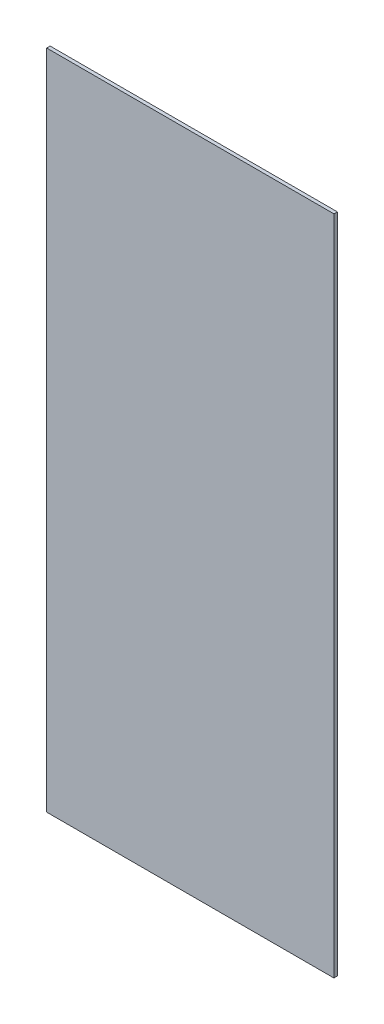
ISO-10303-21;
HEADER;
FILE_DESCRIPTION(('STEP AP214'),'2;1');
FILE_NAME('part.step','',(''),(''),'','','');
FILE_SCHEMA(('AUTOMOTIVE_DESIGN { 1 0 10303 214 1 1 1 1 }'));
ENDSEC;
DATA;
#1=APPLICATION_CONTEXT('core data for automotive mechanical design processes');
#2=APPLICATION_PROTOCOL_DEFINITION('international standard','automotive_design',2000,#1);
#3=PRODUCT_CONTEXT('',#1,'mechanical');
#4=PRODUCT('Part','Part','',(#3));
#5=PRODUCT_RELATED_PRODUCT_CATEGORY('part','',(#4));
#6=PRODUCT_DEFINITION_FORMATION('','',#4);
#7=PRODUCT_DEFINITION_CONTEXT('part definition',#1,'design');
#8=PRODUCT_DEFINITION('design','',#6,#7);
#9=PRODUCT_DEFINITION_SHAPE('','',#8);
#10=(LENGTH_UNIT() NAMED_UNIT(*) SI_UNIT(.MILLI.,.METRE.));
#11=(NAMED_UNIT(*) PLANE_ANGLE_UNIT() SI_UNIT($,.RADIAN.));
#12=(NAMED_UNIT(*) SI_UNIT($,.STERADIAN.) SOLID_ANGLE_UNIT());
#13=UNCERTAINTY_MEASURE_WITH_UNIT(LENGTH_MEASURE(1.E-05),#10,'distance_accuracy_value','');
#14=(GEOMETRIC_REPRESENTATION_CONTEXT(3) GLOBAL_UNCERTAINTY_ASSIGNED_CONTEXT((#13)) GLOBAL_UNIT_ASSIGNED_CONTEXT((#10,
#11,#12)) REPRESENTATION_CONTEXT('',''));
#15=CARTESIAN_POINT('',(0.,0.,0.));
#16=DIRECTION('',(0.,0.,1.));
#17=DIRECTION('',(1.,0.,0.));
#18=AXIS2_PLACEMENT_3D('',#15,#16,#17);
#19=CARTESIAN_POINT('',(125.,-288.,3.));
#20=DIRECTION('',(-1.,0.,0.));
#21=DIRECTION('',(0.,0.,1.));
#22=AXIS2_PLACEMENT_3D('',#19,#20,#21);
#23=PLANE('',#22);
#24=DIRECTION('',(0.,1.,0.));
#25=VECTOR('',#24,1.);
#26=CARTESIAN_POINT('',(125.,-288.,0.));
#27=LINE('',#26,#25);
#28=CARTESIAN_POINT('',(125.,-288.,0.));
#29=VERTEX_POINT('',#28);
#30=CARTESIAN_POINT('',(125.,288.,0.));
#31=VERTEX_POINT('',#30);
#32=EDGE_CURVE('E96',#29,#31,#27,.T.);
#33=ORIENTED_EDGE('',*,*,#32,.T.);
#34=DIRECTION('',(0.,0.,-1.));
#35=VECTOR('',#34,1.);
#36=CARTESIAN_POINT('',(125.,288.,3.));
#37=LINE('',#36,#35);
#38=CARTESIAN_POINT('',(125.,288.,3.));
#39=VERTEX_POINT('',#38);
#40=EDGE_CURVE('E11',#39,#31,#37,.T.);
#41=ORIENTED_EDGE('',*,*,#40,.F.);
#42=DIRECTION('',(0.,1.,0.));
#43=VECTOR('',#42,1.);
#44=CARTESIAN_POINT('',(125.,-288.,3.));
#45=LINE('',#44,#43);
#46=CARTESIAN_POINT('',(125.,-288.,3.));
#47=VERTEX_POINT('',#46);
#48=EDGE_CURVE('E84',#47,#39,#45,.T.);
#49=ORIENTED_EDGE('',*,*,#48,.F.);
#50=DIRECTION('',(0.,0.,-1.));
#51=VECTOR('',#50,1.);
#52=CARTESIAN_POINT('',(125.,-288.,3.));
#53=LINE('',#52,#51);
#54=EDGE_CURVE('E92',#47,#29,#53,.T.);
#55=ORIENTED_EDGE('',*,*,#54,.T.);
#56=EDGE_LOOP('',(#33,#41,#49,#55));
#57=FACE_BOUND('',#56,.T.);
#58=ADVANCED_FACE('F33',(#57),#23,.F.);
#59=CARTESIAN_POINT('',(-125.,288.,3.));
#60=DIRECTION('',(0.,-1.,0.));
#61=DIRECTION('',(0.,0.,-1.));
#62=AXIS2_PLACEMENT_3D('',#59,#60,#61);
#63=PLANE('',#62);
#64=DIRECTION('',(-1.,0.,0.));
#65=VECTOR('',#64,1.);
#66=CARTESIAN_POINT('',(-125.,288.,0.));
#67=LINE('',#66,#65);
#68=CARTESIAN_POINT('',(-125.,288.,0.));
#69=VERTEX_POINT('',#68);
#70=EDGE_CURVE('E88',#31,#69,#67,.T.);
#71=ORIENTED_EDGE('',*,*,#70,.T.);
#72=DIRECTION('',(0.,0.,-1.));
#73=VECTOR('',#72,1.);
#74=CARTESIAN_POINT('',(-125.,288.,3.));
#75=LINE('',#74,#73);
#76=CARTESIAN_POINT('',(-125.,288.,3.));
#77=VERTEX_POINT('',#76);
#78=EDGE_CURVE('E41',#77,#69,#75,.T.);
#79=ORIENTED_EDGE('',*,*,#78,.F.);
#80=DIRECTION('',(-1.,0.,0.));
#81=VECTOR('',#80,1.);
#82=CARTESIAN_POINT('',(-125.,288.,3.));
#83=LINE('',#82,#81);
#84=EDGE_CURVE('E79',#39,#77,#83,.T.);
#85=ORIENTED_EDGE('',*,*,#84,.F.);
#86=ORIENTED_EDGE('',*,*,#40,.T.);
#87=EDGE_LOOP('',(#71,#79,#85,#86));
#88=FACE_BOUND('',#87,.T.);
#89=ADVANCED_FACE('F87',(#88),#63,.F.);
#90=CARTESIAN_POINT('',(-125.,-288.,3.));
#91=DIRECTION('',(1.,0.,0.));
#92=DIRECTION('',(0.,0.,-1.));
#93=AXIS2_PLACEMENT_3D('',#90,#91,#92);
#94=PLANE('',#93);
#95=DIRECTION('',(0.,-1.,0.));
#96=VECTOR('',#95,1.);
#97=CARTESIAN_POINT('',(-125.,-288.,0.));
#98=LINE('',#97,#96);
#99=CARTESIAN_POINT('',(-125.,-288.,0.));
#100=VERTEX_POINT('',#99);
#101=EDGE_CURVE('E66',#69,#100,#98,.T.);
#102=ORIENTED_EDGE('',*,*,#101,.T.);
#103=DIRECTION('',(0.,0.,-1.));
#104=VECTOR('',#103,1.);
#105=CARTESIAN_POINT('',(-125.,-288.,3.));
#106=LINE('',#105,#104);
#107=CARTESIAN_POINT('',(-125.,-288.,3.));
#108=VERTEX_POINT('',#107);
#109=EDGE_CURVE('E89',#108,#100,#106,.T.);
#110=ORIENTED_EDGE('',*,*,#109,.F.);
#111=DIRECTION('',(0.,-1.,0.));
#112=VECTOR('',#111,1.);
#113=CARTESIAN_POINT('',(-125.,-288.,3.));
#114=LINE('',#113,#112);
#115=EDGE_CURVE('E82',#77,#108,#114,.T.);
#116=ORIENTED_EDGE('',*,*,#115,.F.);
#117=ORIENTED_EDGE('',*,*,#78,.T.);
#118=EDGE_LOOP('',(#102,#110,#116,#117));
#119=FACE_BOUND('',#118,.T.);
#120=ADVANCED_FACE('F90',(#119),#94,.F.);
#121=CARTESIAN_POINT('',(-125.,-288.,3.));
#122=DIRECTION('',(0.,1.,0.));
#123=DIRECTION('',(0.,0.,1.));
#124=AXIS2_PLACEMENT_3D('',#121,#122,#123);
#125=PLANE('',#124);
#126=DIRECTION('',(1.,0.,0.));
#127=VECTOR('',#126,1.);
#128=CARTESIAN_POINT('',(-125.,-288.,0.));
#129=LINE('',#128,#127);
#130=EDGE_CURVE('E72',#100,#29,#129,.T.);
#131=ORIENTED_EDGE('',*,*,#130,.T.);
#132=ORIENTED_EDGE('',*,*,#54,.F.);
#133=DIRECTION('',(1.,0.,0.));
#134=VECTOR('',#133,1.);
#135=CARTESIAN_POINT('',(-125.,-288.,3.));
#136=LINE('',#135,#134);
#137=EDGE_CURVE('E49',#108,#47,#136,.T.);
#138=ORIENTED_EDGE('',*,*,#137,.F.);
#139=ORIENTED_EDGE('',*,*,#109,.T.);
#140=EDGE_LOOP('',(#131,#132,#138,#139));
#141=FACE_BOUND('',#140,.T.);
#142=ADVANCED_FACE('F103',(#141),#125,.F.);
#143=CARTESIAN_POINT('',(0.,0.,3.));
#144=DIRECTION('',(0.,0.,-1.));
#145=DIRECTION('',(-1.,0.,0.));
#146=AXIS2_PLACEMENT_3D('',#143,#144,#145);
#147=PLANE('',#146);
#148=ORIENTED_EDGE('',*,*,#48,.T.);
#149=ORIENTED_EDGE('',*,*,#84,.T.);
#150=ORIENTED_EDGE('',*,*,#115,.T.);
#151=ORIENTED_EDGE('',*,*,#137,.T.);
#152=EDGE_LOOP('',(#148,#149,#150,#151));
#153=FACE_BOUND('',#152,.T.);
#154=ADVANCED_FACE('F80',(#153),#147,.F.);
#155=CARTESIAN_POINT('',(0.,0.,0.));
#156=DIRECTION('',(0.,0.,-1.));
#157=DIRECTION('',(-1.,0.,0.));
#158=AXIS2_PLACEMENT_3D('',#155,#156,#157);
#159=PLANE('',#158);
#160=ORIENTED_EDGE('',*,*,#32,.F.);
#161=ORIENTED_EDGE('',*,*,#130,.F.);
#162=ORIENTED_EDGE('',*,*,#101,.F.);
#163=ORIENTED_EDGE('',*,*,#70,.F.);
#164=EDGE_LOOP('',(#160,#161,#162,#163));
#165=FACE_BOUND('',#164,.T.);
#166=ADVANCED_FACE('F106',(#165),#159,.T.);
#167=CLOSED_SHELL('',(#58,#89,#120,#142,#154,#166));
#168=MANIFOLD_SOLID_BREP('B2',#167);
#169=ADVANCED_BREP_SHAPE_REPRESENTATION('',(#18,#168),#14);
#170=SHAPE_DEFINITION_REPRESENTATION(#9,#169);
ENDSEC;
END-ISO-10303-21;
